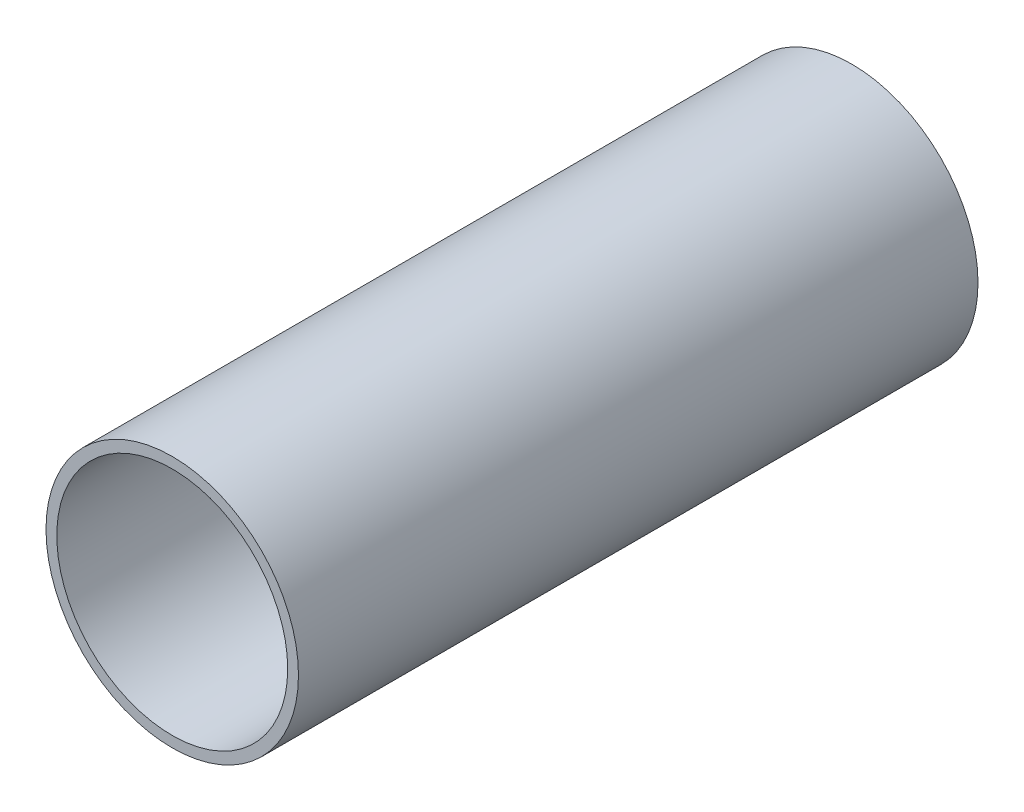
ISO-10303-21;
HEADER;
FILE_DESCRIPTION(('STEP AP214'),'2;1');
FILE_NAME('part.step','',(''),(''),'','','');
FILE_SCHEMA(('AUTOMOTIVE_DESIGN { 1 0 10303 214 1 1 1 1 }'));
ENDSEC;
DATA;
#1=APPLICATION_CONTEXT('core data for automotive mechanical design processes');
#2=APPLICATION_PROTOCOL_DEFINITION('international standard','automotive_design',2000,#1);
#3=PRODUCT_CONTEXT('',#1,'mechanical');
#4=PRODUCT('Part','Part','',(#3));
#5=PRODUCT_RELATED_PRODUCT_CATEGORY('part','',(#4));
#6=PRODUCT_DEFINITION_FORMATION('','',#4);
#7=PRODUCT_DEFINITION_CONTEXT('part definition',#1,'design');
#8=PRODUCT_DEFINITION('design','',#6,#7);
#9=PRODUCT_DEFINITION_SHAPE('','',#8);
#10=(LENGTH_UNIT() NAMED_UNIT(*) SI_UNIT(.MILLI.,.METRE.));
#11=(NAMED_UNIT(*) PLANE_ANGLE_UNIT() SI_UNIT($,.RADIAN.));
#12=(NAMED_UNIT(*) SI_UNIT($,.STERADIAN.) SOLID_ANGLE_UNIT());
#13=UNCERTAINTY_MEASURE_WITH_UNIT(LENGTH_MEASURE(1.E-05),#10,'distance_accuracy_value','');
#14=(GEOMETRIC_REPRESENTATION_CONTEXT(3) GLOBAL_UNCERTAINTY_ASSIGNED_CONTEXT((#13)) GLOBAL_UNIT_ASSIGNED_CONTEXT((#10,
#11,#12)) REPRESENTATION_CONTEXT('',''));
#15=CARTESIAN_POINT('',(0.,0.,0.));
#16=DIRECTION('',(0.,0.,1.));
#17=DIRECTION('',(1.,0.,0.));
#18=AXIS2_PLACEMENT_3D('',#15,#16,#17);
#19=CARTESIAN_POINT('',(0.,0.,457.2));
#20=DIRECTION('',(0.,0.,1.));
#21=DIRECTION('',(1.,0.,0.));
#22=AXIS2_PLACEMENT_3D('',#19,#20,#21);
#23=PLANE('',#22);
#24=CARTESIAN_POINT('',(0.,0.,457.2));
#25=DIRECTION('',(0.,0.,1.));
#26=DIRECTION('',(1.,0.,0.));
#27=AXIS2_PLACEMENT_3D('',#24,#25,#26);
#28=CIRCLE('',#27,84.93125);
#29=CARTESIAN_POINT('',(84.93125,0.,457.2));
#30=VERTEX_POINT('',#29);
#31=EDGE_CURVE('E10',#30,#30,#28,.T.);
#32=ORIENTED_EDGE('',*,*,#31,.T.);
#33=EDGE_LOOP('',(#32));
#34=FACE_BOUND('',#33,.T.);
#35=CARTESIAN_POINT('',(0.,0.,457.2));
#36=DIRECTION('',(0.,0.,1.));
#37=DIRECTION('',(1.,0.,0.));
#38=AXIS2_PLACEMENT_3D('',#35,#36,#37);
#39=CIRCLE('',#38,77.68125);
#40=CARTESIAN_POINT('',(77.68125,0.,457.2));
#41=VERTEX_POINT('',#40);
#42=EDGE_CURVE('E49',#41,#41,#39,.T.);
#43=ORIENTED_EDGE('',*,*,#42,.F.);
#44=EDGE_LOOP('',(#43));
#45=FACE_BOUND('',#44,.T.);
#46=ADVANCED_FACE('F38',(#34,#45),#23,.T.);
#47=CARTESIAN_POINT('',(0.,0.,0.));
#48=DIRECTION('',(0.,0.,1.));
#49=DIRECTION('',(1.,0.,0.));
#50=AXIS2_PLACEMENT_3D('',#47,#48,#49);
#51=PLANE('',#50);
#52=CARTESIAN_POINT('',(0.,0.,0.));
#53=DIRECTION('',(0.,0.,1.));
#54=DIRECTION('',(1.,0.,0.));
#55=AXIS2_PLACEMENT_3D('',#52,#53,#54);
#56=CIRCLE('',#55,84.93125);
#57=CARTESIAN_POINT('',(84.93125,0.,0.));
#58=VERTEX_POINT('',#57);
#59=EDGE_CURVE('E42',#58,#58,#56,.T.);
#60=ORIENTED_EDGE('',*,*,#59,.F.);
#61=EDGE_LOOP('',(#60));
#62=FACE_BOUND('',#61,.T.);
#63=CARTESIAN_POINT('',(0.,0.,0.));
#64=DIRECTION('',(0.,0.,1.));
#65=DIRECTION('',(1.,0.,0.));
#66=AXIS2_PLACEMENT_3D('',#63,#64,#65);
#67=CIRCLE('',#66,77.68125);
#68=CARTESIAN_POINT('',(77.68125,0.,0.));
#69=VERTEX_POINT('',#68);
#70=EDGE_CURVE('E51',#69,#69,#67,.T.);
#71=ORIENTED_EDGE('',*,*,#70,.T.);
#72=EDGE_LOOP('',(#71));
#73=FACE_BOUND('',#72,.T.);
#74=ADVANCED_FACE('F61',(#62,#73),#51,.F.);
#75=CARTESIAN_POINT('',(0.,0.,457.2));
#76=DIRECTION('',(0.,0.,-1.));
#77=DIRECTION('',(-1.,0.,0.));
#78=AXIS2_PLACEMENT_3D('',#75,#76,#77);
#79=CYLINDRICAL_SURFACE('',#78,84.93125);
#80=ORIENTED_EDGE('',*,*,#31,.F.);
#81=EDGE_LOOP('',(#80));
#82=FACE_BOUND('',#81,.T.);
#83=ORIENTED_EDGE('',*,*,#59,.T.);
#84=EDGE_LOOP('',(#83));
#85=FACE_BOUND('',#84,.T.);
#86=ADVANCED_FACE('F40',(#82,#85),#79,.T.);
#87=CARTESIAN_POINT('',(0.,0.,457.2));
#88=DIRECTION('',(0.,0.,-1.));
#89=DIRECTION('',(-1.,0.,0.));
#90=AXIS2_PLACEMENT_3D('',#87,#88,#89);
#91=CYLINDRICAL_SURFACE('',#90,77.68125);
#92=ORIENTED_EDGE('',*,*,#42,.T.);
#93=EDGE_LOOP('',(#92));
#94=FACE_BOUND('',#93,.T.);
#95=ORIENTED_EDGE('',*,*,#70,.F.);
#96=EDGE_LOOP('',(#95));
#97=FACE_BOUND('',#96,.T.);
#98=ADVANCED_FACE('F57',(#94,#97),#91,.F.);
#99=CLOSED_SHELL('',(#46,#74,#86,#98));
#100=MANIFOLD_SOLID_BREP('B2',#99);
#101=ADVANCED_BREP_SHAPE_REPRESENTATION('',(#18,#100),#14);
#102=SHAPE_DEFINITION_REPRESENTATION(#9,#101);
ENDSEC;
END-ISO-10303-21;
